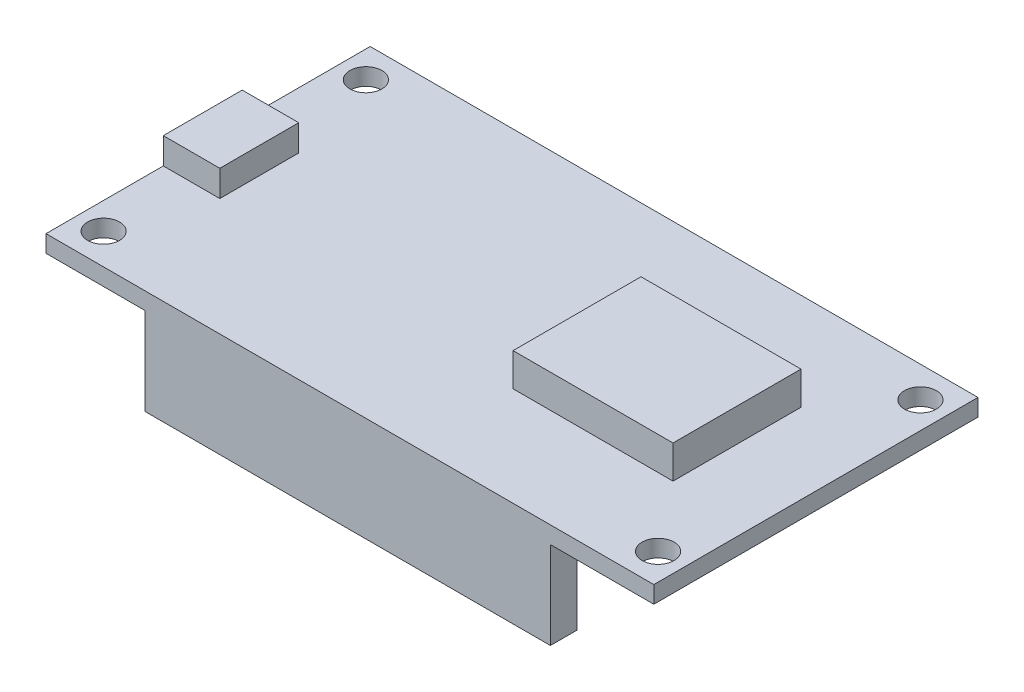
ISO-10303-21;
HEADER;
FILE_DESCRIPTION(('STEP AP214'),'2;1');
FILE_NAME('part.step','',(''),(''),'','','');
FILE_SCHEMA(('AUTOMOTIVE_DESIGN { 1 0 10303 214 1 1 1 1 }'));
ENDSEC;
DATA;
#1=APPLICATION_CONTEXT('core data for automotive mechanical design processes');
#2=APPLICATION_PROTOCOL_DEFINITION('international standard','automotive_design',2000,#1);
#3=PRODUCT_CONTEXT('',#1,'mechanical');
#4=PRODUCT('Part','Part','',(#3));
#5=PRODUCT_RELATED_PRODUCT_CATEGORY('part','',(#4));
#6=PRODUCT_DEFINITION_FORMATION('','',#4);
#7=PRODUCT_DEFINITION_CONTEXT('part definition',#1,'design');
#8=PRODUCT_DEFINITION('design','',#6,#7);
#9=PRODUCT_DEFINITION_SHAPE('','',#8);
#10=(LENGTH_UNIT() NAMED_UNIT(*) SI_UNIT(.MILLI.,.METRE.));
#11=(NAMED_UNIT(*) PLANE_ANGLE_UNIT() SI_UNIT($,.RADIAN.));
#12=(NAMED_UNIT(*) SI_UNIT($,.STERADIAN.) SOLID_ANGLE_UNIT());
#13=UNCERTAINTY_MEASURE_WITH_UNIT(LENGTH_MEASURE(1.E-05),#10,'distance_accuracy_value','');
#14=(GEOMETRIC_REPRESENTATION_CONTEXT(3) GLOBAL_UNCERTAINTY_ASSIGNED_CONTEXT((#13)) GLOBAL_UNIT_ASSIGNED_CONTEXT((#10,
#11,#12)) REPRESENTATION_CONTEXT('',''));
#15=CARTESIAN_POINT('',(0.,0.,0.));
#16=DIRECTION('',(0.,0.,1.));
#17=DIRECTION('',(1.,0.,0.));
#18=AXIS2_PLACEMENT_3D('',#15,#16,#17);
#19=CARTESIAN_POINT('',(0.,0.,0.));
#20=DIRECTION('',(0.,1.,0.));
#21=DIRECTION('',(0.,0.,1.));
#22=AXIS2_PLACEMENT_3D('',#19,#20,#21);
#23=PLANE('',#22);
#24=CARTESIAN_POINT('',(35.099869201977,0.,-10.2520100502513));
#25=DIRECTION('',(0.,1.,0.));
#26=DIRECTION('',(0.,0.,1.));
#27=AXIS2_PLACEMENT_3D('',#24,#25,#26);
#28=CIRCLE('',#27,1.5);
#29=CARTESIAN_POINT('',(35.099869201977,0.,-8.75201005025125));
#30=VERTEX_POINT('',#29);
#31=EDGE_CURVE('E237',#30,#30,#28,.T.);
#32=ORIENTED_EDGE('',*,*,#31,.T.);
#33=EDGE_LOOP('',(#32));
#34=FACE_BOUND('',#33,.T.);
#35=CARTESIAN_POINT('',(35.099869201977,0.,14.3479899497487));
#36=DIRECTION('',(0.,1.,0.));
#37=DIRECTION('',(0.,0.,1.));
#38=AXIS2_PLACEMENT_3D('',#35,#36,#37);
#39=CIRCLE('',#38,1.5);
#40=CARTESIAN_POINT('',(35.099869201977,0.,15.8479899497487));
#41=VERTEX_POINT('',#40);
#42=EDGE_CURVE('E231',#41,#41,#39,.T.);
#43=ORIENTED_EDGE('',*,*,#42,.T.);
#44=EDGE_LOOP('',(#43));
#45=FACE_BOUND('',#44,.T.);
#46=CARTESIAN_POINT('',(-16.900130798023,0.,14.3479899497487));
#47=DIRECTION('',(0.,1.,0.));
#48=DIRECTION('',(0.,0.,1.));
#49=AXIS2_PLACEMENT_3D('',#46,#47,#48);
#50=CIRCLE('',#49,1.5);
#51=CARTESIAN_POINT('',(-16.900130798023,0.,15.8479899497487));
#52=VERTEX_POINT('',#51);
#53=EDGE_CURVE('E224',#52,#52,#50,.T.);
#54=ORIENTED_EDGE('',*,*,#53,.T.);
#55=EDGE_LOOP('',(#54));
#56=FACE_BOUND('',#55,.T.);
#57=CARTESIAN_POINT('',(-16.900130798023,0.,-10.2520100502513));
#58=DIRECTION('',(0.,1.,0.));
#59=DIRECTION('',(0.,0.,1.));
#60=AXIS2_PLACEMENT_3D('',#57,#58,#59);
#61=CIRCLE('',#60,1.5);
#62=CARTESIAN_POINT('',(-16.900130798023,0.,-8.75201005025126));
#63=VERTEX_POINT('',#62);
#64=EDGE_CURVE('E242',#63,#63,#61,.T.);
#65=ORIENTED_EDGE('',*,*,#64,.T.);
#66=EDGE_LOOP('',(#65));
#67=FACE_BOUND('',#66,.T.);
#68=DIRECTION('',(0.,0.,-1.));
#69=VECTOR('',#68,1.);
#70=CARTESIAN_POINT('',(-10.100130798023,0.,-10.6520100502513));
#71=LINE('',#70,#69);
#72=CARTESIAN_POINT('',(-10.100130798023,0.,-10.6520100502513));
#73=VERTEX_POINT('',#72);
#74=CARTESIAN_POINT('',(-10.100130798023,0.,-13.1520100502513));
#75=VERTEX_POINT('',#74);
#76=EDGE_CURVE('E48',#73,#75,#71,.T.);
#77=ORIENTED_EDGE('',*,*,#76,.F.);
#78=DIRECTION('',(-1.,0.,0.));
#79=VECTOR('',#78,1.);
#80=CARTESIAN_POINT('',(-10.100130798023,0.,-10.6520100502513));
#81=LINE('',#80,#79);
#82=CARTESIAN_POINT('',(27.899869201977,0.,-10.6520100502513));
#83=VERTEX_POINT('',#82);
#84=EDGE_CURVE('E188',#83,#73,#81,.T.);
#85=ORIENTED_EDGE('',*,*,#84,.F.);
#86=DIRECTION('',(0.,0.,1.));
#87=VECTOR('',#86,1.);
#88=CARTESIAN_POINT('',(27.899869201977,0.,-10.6520100502513));
#89=LINE('',#88,#87);
#90=CARTESIAN_POINT('',(27.899869201977,0.,-13.1520100502513));
#91=VERTEX_POINT('',#90);
#92=EDGE_CURVE('E344',#91,#83,#89,.T.);
#93=ORIENTED_EDGE('',*,*,#92,.F.);
#94=DIRECTION('',(-1.,0.,0.));
#95=VECTOR('',#94,1.);
#96=CARTESIAN_POINT('',(-19.400130798023,0.,-13.1520100502513));
#97=LINE('',#96,#95);
#98=CARTESIAN_POINT('',(37.599869201977,0.,-13.1520100502513));
#99=VERTEX_POINT('',#98);
#100=EDGE_CURVE('E326',#99,#91,#97,.T.);
#101=ORIENTED_EDGE('',*,*,#100,.F.);
#102=DIRECTION('',(0.,0.,-1.));
#103=VECTOR('',#102,1.);
#104=CARTESIAN_POINT('',(37.599869201977,0.,-13.1520100502513));
#105=LINE('',#104,#103);
#106=CARTESIAN_POINT('',(37.599869201977,0.,17.2479899497487));
#107=VERTEX_POINT('',#106);
#108=EDGE_CURVE('E323',#107,#99,#105,.T.);
#109=ORIENTED_EDGE('',*,*,#108,.F.);
#110=DIRECTION('',(1.,0.,0.));
#111=VECTOR('',#110,1.);
#112=CARTESIAN_POINT('',(-19.400130798023,0.,17.2479899497487));
#113=LINE('',#112,#111);
#114=CARTESIAN_POINT('',(27.899869201977,0.,17.2479899497487));
#115=VERTEX_POINT('',#114);
#116=EDGE_CURVE('E319',#115,#107,#113,.T.);
#117=ORIENTED_EDGE('',*,*,#116,.F.);
#118=DIRECTION('',(0.,0.,1.));
#119=VECTOR('',#118,1.);
#120=CARTESIAN_POINT('',(27.899869201977,0.,17.2479899497487));
#121=LINE('',#120,#119);
#122=CARTESIAN_POINT('',(27.899869201977,0.,14.7479899497487));
#123=VERTEX_POINT('',#122);
#124=EDGE_CURVE('E203',#123,#115,#121,.T.);
#125=ORIENTED_EDGE('',*,*,#124,.F.);
#126=DIRECTION('',(1.,0.,0.));
#127=VECTOR('',#126,1.);
#128=CARTESIAN_POINT('',(-10.100130798023,0.,14.7479899497487));
#129=LINE('',#128,#127);
#130=CARTESIAN_POINT('',(-10.100130798023,0.,14.7479899497487));
#131=VERTEX_POINT('',#130);
#132=EDGE_CURVE('E56',#131,#123,#129,.T.);
#133=ORIENTED_EDGE('',*,*,#132,.F.);
#134=DIRECTION('',(0.,0.,-1.));
#135=VECTOR('',#134,1.);
#136=CARTESIAN_POINT('',(-10.100130798023,0.,17.2479899497487));
#137=LINE('',#136,#135);
#138=CARTESIAN_POINT('',(-10.100130798023,0.,17.2479899497487));
#139=VERTEX_POINT('',#138);
#140=EDGE_CURVE('E191',#139,#131,#137,.T.);
#141=ORIENTED_EDGE('',*,*,#140,.F.);
#142=CARTESIAN_POINT('',(-19.400130798023,0.,17.2479899497487));
#143=VERTEX_POINT('',#142);
#144=EDGE_CURVE('E320',#143,#139,#113,.T.);
#145=ORIENTED_EDGE('',*,*,#144,.F.);
#146=DIRECTION('',(0.,0.,1.));
#147=VECTOR('',#146,1.);
#148=CARTESIAN_POINT('',(-19.400130798023,0.,-13.1520100502513));
#149=LINE('',#148,#147);
#150=CARTESIAN_POINT('',(-19.400130798023,0.,-13.1520100502513));
#151=VERTEX_POINT('',#150);
#152=EDGE_CURVE('E306',#151,#143,#149,.T.);
#153=ORIENTED_EDGE('',*,*,#152,.F.);
#154=EDGE_CURVE('E325',#75,#151,#97,.T.);
#155=ORIENTED_EDGE('',*,*,#154,.F.);
#156=EDGE_LOOP('',(#77,#85,#93,#101,#109,#117,#125,#133,#141,#145,#153,#155));
#157=FACE_BOUND('',#156,.T.);
#158=ADVANCED_FACE('F33',(#34,#45,#56,#67,#157),#23,.F.);
#159=CARTESIAN_POINT('',(0.,1.6,0.));
#160=DIRECTION('',(0.,1.,0.));
#161=DIRECTION('',(0.,0.,1.));
#162=AXIS2_PLACEMENT_3D('',#159,#160,#161);
#163=PLANE('',#162);
#164=CARTESIAN_POINT('',(35.099869201977,1.6,-10.2520100502513));
#165=DIRECTION('',(0.,1.,0.));
#166=DIRECTION('',(0.,0.,1.));
#167=AXIS2_PLACEMENT_3D('',#164,#165,#166);
#168=CIRCLE('',#167,1.5);
#169=CARTESIAN_POINT('',(35.099869201977,1.6,-8.75201005025125));
#170=VERTEX_POINT('',#169);
#171=EDGE_CURVE('E223',#170,#170,#168,.T.);
#172=ORIENTED_EDGE('',*,*,#171,.F.);
#173=EDGE_LOOP('',(#172));
#174=FACE_BOUND('',#173,.T.);
#175=CARTESIAN_POINT('',(35.099869201977,1.6,14.3479899497487));
#176=DIRECTION('',(0.,1.,0.));
#177=DIRECTION('',(0.,0.,1.));
#178=AXIS2_PLACEMENT_3D('',#175,#176,#177);
#179=CIRCLE('',#178,1.5);
#180=CARTESIAN_POINT('',(35.099869201977,1.6,15.8479899497487));
#181=VERTEX_POINT('',#180);
#182=EDGE_CURVE('E234',#181,#181,#179,.T.);
#183=ORIENTED_EDGE('',*,*,#182,.F.);
#184=EDGE_LOOP('',(#183));
#185=FACE_BOUND('',#184,.T.);
#186=CARTESIAN_POINT('',(-16.900130798023,1.6,14.3479899497487));
#187=DIRECTION('',(0.,1.,0.));
#188=DIRECTION('',(0.,0.,1.));
#189=AXIS2_PLACEMENT_3D('',#186,#187,#188);
#190=CIRCLE('',#189,1.5);
#191=CARTESIAN_POINT('',(-16.900130798023,1.6,15.8479899497487));
#192=VERTEX_POINT('',#191);
#193=EDGE_CURVE('E228',#192,#192,#190,.T.);
#194=ORIENTED_EDGE('',*,*,#193,.F.);
#195=EDGE_LOOP('',(#194));
#196=FACE_BOUND('',#195,.T.);
#197=CARTESIAN_POINT('',(-16.900130798023,1.6,-10.2520100502513));
#198=DIRECTION('',(0.,1.,0.));
#199=DIRECTION('',(0.,0.,1.));
#200=AXIS2_PLACEMENT_3D('',#197,#198,#199);
#201=CIRCLE('',#200,1.5);
#202=CARTESIAN_POINT('',(-16.900130798023,1.6,-8.75201005025126));
#203=VERTEX_POINT('',#202);
#204=EDGE_CURVE('E227',#203,#203,#201,.T.);
#205=ORIENTED_EDGE('',*,*,#204,.F.);
#206=EDGE_LOOP('',(#205));
#207=FACE_BOUND('',#206,.T.);
#208=DIRECTION('',(1.,0.,0.));
#209=VECTOR('',#208,1.);
#210=CARTESIAN_POINT('',(15.099869201977,1.6,7.94798994974874));
#211=LINE('',#210,#209);
#212=CARTESIAN_POINT('',(15.099869201977,1.6,7.94798994974874));
#213=VERTEX_POINT('',#212);
#214=CARTESIAN_POINT('',(30.099869201977,1.6,7.94798994974874));
#215=VERTEX_POINT('',#214);
#216=EDGE_CURVE('E291',#213,#215,#211,.T.);
#217=ORIENTED_EDGE('',*,*,#216,.F.);
#218=DIRECTION('',(0.,0.,1.));
#219=VECTOR('',#218,1.);
#220=CARTESIAN_POINT('',(15.099869201977,1.6,-4.05201005025126));
#221=LINE('',#220,#219);
#222=CARTESIAN_POINT('',(15.099869201977,1.6,-4.05201005025126));
#223=VERTEX_POINT('',#222);
#224=EDGE_CURVE('E277',#223,#213,#221,.T.);
#225=ORIENTED_EDGE('',*,*,#224,.F.);
#226=DIRECTION('',(-1.,0.,0.));
#227=VECTOR('',#226,1.);
#228=CARTESIAN_POINT('',(15.099869201977,1.6,-4.05201005025126));
#229=LINE('',#228,#227);
#230=CARTESIAN_POINT('',(30.099869201977,1.6,-4.05201005025126));
#231=VERTEX_POINT('',#230);
#232=EDGE_CURVE('E282',#231,#223,#229,.T.);
#233=ORIENTED_EDGE('',*,*,#232,.F.);
#234=DIRECTION('',(0.,0.,-1.));
#235=VECTOR('',#234,1.);
#236=CARTESIAN_POINT('',(30.099869201977,1.6,-4.05201005025126));
#237=LINE('',#236,#235);
#238=EDGE_CURVE('E293',#215,#231,#237,.T.);
#239=ORIENTED_EDGE('',*,*,#238,.F.);
#240=EDGE_LOOP('',(#217,#225,#233,#239));
#241=FACE_BOUND('',#240,.T.);
#242=DIRECTION('',(0.,0.,-1.));
#243=VECTOR('',#242,1.);
#244=CARTESIAN_POINT('',(-14.100130798023,1.6,-1.15201005025126));
#245=LINE('',#244,#243);
#246=CARTESIAN_POINT('',(-14.100130798023,1.6,6.24798994974874));
#247=VERTEX_POINT('',#246);
#248=CARTESIAN_POINT('',(-14.100130798023,1.6,-1.15201005025126));
#249=VERTEX_POINT('',#248);
#250=EDGE_CURVE('E261',#247,#249,#245,.T.);
#251=ORIENTED_EDGE('',*,*,#250,.F.);
#252=DIRECTION('',(1.,0.,0.));
#253=VECTOR('',#252,1.);
#254=CARTESIAN_POINT('',(-19.400130798023,1.6,6.24798994974874));
#255=LINE('',#254,#253);
#256=CARTESIAN_POINT('',(-19.400130798023,1.6,6.24798994974874));
#257=VERTEX_POINT('',#256);
#258=EDGE_CURVE('E245',#257,#247,#255,.T.);
#259=ORIENTED_EDGE('',*,*,#258,.F.);
#260=DIRECTION('',(0.,0.,1.));
#261=VECTOR('',#260,1.);
#262=CARTESIAN_POINT('',(-19.400130798023,1.6,-13.1520100502513));
#263=LINE('',#262,#261);
#264=CARTESIAN_POINT('',(-19.400130798023,1.6,17.2479899497487));
#265=VERTEX_POINT('',#264);
#266=EDGE_CURVE('E310',#257,#265,#263,.T.);
#267=ORIENTED_EDGE('',*,*,#266,.T.);
#268=DIRECTION('',(1.,0.,0.));
#269=VECTOR('',#268,1.);
#270=CARTESIAN_POINT('',(-19.400130798023,1.6,17.2479899497487));
#271=LINE('',#270,#269);
#272=CARTESIAN_POINT('',(37.599869201977,1.6,17.2479899497487));
#273=VERTEX_POINT('',#272);
#274=EDGE_CURVE('E309',#265,#273,#271,.T.);
#275=ORIENTED_EDGE('',*,*,#274,.T.);
#276=DIRECTION('',(0.,0.,-1.));
#277=VECTOR('',#276,1.);
#278=CARTESIAN_POINT('',(37.599869201977,1.6,-13.1520100502513));
#279=LINE('',#278,#277);
#280=CARTESIAN_POINT('',(37.599869201977,1.6,-13.1520100502513));
#281=VERTEX_POINT('',#280);
#282=EDGE_CURVE('E312',#273,#281,#279,.T.);
#283=ORIENTED_EDGE('',*,*,#282,.T.);
#284=DIRECTION('',(-1.,0.,0.));
#285=VECTOR('',#284,1.);
#286=CARTESIAN_POINT('',(-19.400130798023,1.6,-13.1520100502513));
#287=LINE('',#286,#285);
#288=CARTESIAN_POINT('',(-19.400130798023,1.6,-13.1520100502513));
#289=VERTEX_POINT('',#288);
#290=EDGE_CURVE('E314',#281,#289,#287,.T.);
#291=ORIENTED_EDGE('',*,*,#290,.T.);
#292=CARTESIAN_POINT('',(-19.400130798023,1.6,-1.15201005025126));
#293=VERTEX_POINT('',#292);
#294=EDGE_CURVE('E307',#289,#293,#263,.T.);
#295=ORIENTED_EDGE('',*,*,#294,.T.);
#296=DIRECTION('',(-1.,0.,0.));
#297=VECTOR('',#296,1.);
#298=CARTESIAN_POINT('',(-19.400130798023,1.6,-1.15201005025126));
#299=LINE('',#298,#297);
#300=EDGE_CURVE('E252',#249,#293,#299,.T.);
#301=ORIENTED_EDGE('',*,*,#300,.F.);
#302=EDGE_LOOP('',(#251,#259,#267,#275,#283,#291,#295,#301));
#303=FACE_BOUND('',#302,.T.);
#304=ADVANCED_FACE('F349',(#174,#185,#196,#207,#241,#303),#163,.T.);
#305=CARTESIAN_POINT('',(-19.400130798023,1.6,-13.1520100502513));
#306=DIRECTION('',(1.,0.,0.));
#307=DIRECTION('',(0.,0.,-1.));
#308=AXIS2_PLACEMENT_3D('',#305,#306,#307);
#309=PLANE('',#308);
#310=ORIENTED_EDGE('',*,*,#152,.T.);
#311=DIRECTION('',(0.,-1.,0.));
#312=VECTOR('',#311,1.);
#313=CARTESIAN_POINT('',(-19.400130798023,1.6,17.2479899497487));
#314=LINE('',#313,#312);
#315=EDGE_CURVE('E11',#265,#143,#314,.T.);
#316=ORIENTED_EDGE('',*,*,#315,.F.);
#317=ORIENTED_EDGE('',*,*,#266,.F.);
#318=DIRECTION('',(0.,-1.,0.));
#319=VECTOR('',#318,1.);
#320=CARTESIAN_POINT('',(-19.400130798023,4.06,6.24798994974874));
#321=LINE('',#320,#319);
#322=CARTESIAN_POINT('',(-19.400130798023,4.06,6.24798994974874));
#323=VERTEX_POINT('',#322);
#324=EDGE_CURVE('E274',#323,#257,#321,.T.);
#325=ORIENTED_EDGE('',*,*,#324,.F.);
#326=DIRECTION('',(0.,0.,1.));
#327=VECTOR('',#326,1.);
#328=CARTESIAN_POINT('',(-19.400130798023,4.06,-1.15201005025126));
#329=LINE('',#328,#327);
#330=CARTESIAN_POINT('',(-19.400130798023,4.06,-1.15201005025126));
#331=VERTEX_POINT('',#330);
#332=EDGE_CURVE('E248',#331,#323,#329,.T.);
#333=ORIENTED_EDGE('',*,*,#332,.F.);
#334=DIRECTION('',(0.,-1.,0.));
#335=VECTOR('',#334,1.);
#336=CARTESIAN_POINT('',(-19.400130798023,4.06,-1.15201005025126));
#337=LINE('',#336,#335);
#338=EDGE_CURVE('E258',#331,#293,#337,.T.);
#339=ORIENTED_EDGE('',*,*,#338,.T.);
#340=ORIENTED_EDGE('',*,*,#294,.F.);
#341=DIRECTION('',(0.,-1.,0.));
#342=VECTOR('',#341,1.);
#343=CARTESIAN_POINT('',(-19.400130798023,1.6,-13.1520100502513));
#344=LINE('',#343,#342);
#345=EDGE_CURVE('E316',#289,#151,#344,.T.);
#346=ORIENTED_EDGE('',*,*,#345,.T.);
#347=EDGE_LOOP('',(#310,#316,#317,#325,#333,#339,#340,#346));
#348=FACE_BOUND('',#347,.T.);
#349=ADVANCED_FACE('F35',(#348),#309,.F.);
#350=CARTESIAN_POINT('',(-19.400130798023,1.6,17.2479899497487));
#351=DIRECTION('',(0.,0.,-1.));
#352=DIRECTION('',(-1.,0.,0.));
#353=AXIS2_PLACEMENT_3D('',#350,#351,#352);
#354=PLANE('',#353);
#355=ORIENTED_EDGE('',*,*,#144,.T.);
#356=DIRECTION('',(0.,1.,0.));
#357=VECTOR('',#356,1.);
#358=CARTESIAN_POINT('',(-10.100130798023,-8.2,17.2479899497487));
#359=LINE('',#358,#357);
#360=CARTESIAN_POINT('',(-10.100130798023,-8.2,17.2479899497487));
#361=VERTEX_POINT('',#360);
#362=EDGE_CURVE('E208',#361,#139,#359,.T.);
#363=ORIENTED_EDGE('',*,*,#362,.F.);
#364=DIRECTION('',(-1.,0.,0.));
#365=VECTOR('',#364,1.);
#366=CARTESIAN_POINT('',(-10.100130798023,-8.2,17.2479899497487));
#367=LINE('',#366,#365);
#368=CARTESIAN_POINT('',(27.899869201977,-8.2,17.2479899497487));
#369=VERTEX_POINT('',#368);
#370=EDGE_CURVE('E207',#369,#361,#367,.T.);
#371=ORIENTED_EDGE('',*,*,#370,.F.);
#372=DIRECTION('',(0.,1.,0.));
#373=VECTOR('',#372,1.);
#374=CARTESIAN_POINT('',(27.899869201977,-8.2,17.2479899497487));
#375=LINE('',#374,#373);
#376=EDGE_CURVE('E215',#369,#115,#375,.T.);
#377=ORIENTED_EDGE('',*,*,#376,.T.);
#378=ORIENTED_EDGE('',*,*,#116,.T.);
#379=DIRECTION('',(0.,-1.,0.));
#380=VECTOR('',#379,1.);
#381=CARTESIAN_POINT('',(37.599869201977,1.6,17.2479899497487));
#382=LINE('',#381,#380);
#383=EDGE_CURVE('E41',#273,#107,#382,.T.);
#384=ORIENTED_EDGE('',*,*,#383,.F.);
#385=ORIENTED_EDGE('',*,*,#274,.F.);
#386=ORIENTED_EDGE('',*,*,#315,.T.);
#387=EDGE_LOOP('',(#355,#363,#371,#377,#378,#384,#385,#386));
#388=FACE_BOUND('',#387,.T.);
#389=ADVANCED_FACE('F352',(#388),#354,.F.);
#390=CARTESIAN_POINT('',(37.599869201977,1.6,-13.1520100502513));
#391=DIRECTION('',(-1.,0.,0.));
#392=DIRECTION('',(0.,0.,1.));
#393=AXIS2_PLACEMENT_3D('',#390,#391,#392);
#394=PLANE('',#393);
#395=ORIENTED_EDGE('',*,*,#108,.T.);
#396=DIRECTION('',(0.,-1.,0.));
#397=VECTOR('',#396,1.);
#398=CARTESIAN_POINT('',(37.599869201977,1.6,-13.1520100502513));
#399=LINE('',#398,#397);
#400=EDGE_CURVE('E330',#281,#99,#399,.T.);
#401=ORIENTED_EDGE('',*,*,#400,.F.);
#402=ORIENTED_EDGE('',*,*,#282,.F.);
#403=ORIENTED_EDGE('',*,*,#383,.T.);
#404=EDGE_LOOP('',(#395,#401,#402,#403));
#405=FACE_BOUND('',#404,.T.);
#406=ADVANCED_FACE('F337',(#405),#394,.F.);
#407=CARTESIAN_POINT('',(-19.400130798023,1.6,-13.1520100502513));
#408=DIRECTION('',(0.,0.,1.));
#409=DIRECTION('',(1.,0.,0.));
#410=AXIS2_PLACEMENT_3D('',#407,#408,#409);
#411=PLANE('',#410);
#412=ORIENTED_EDGE('',*,*,#100,.T.);
#413=DIRECTION('',(0.,1.,0.));
#414=VECTOR('',#413,1.);
#415=CARTESIAN_POINT('',(27.899869201977,-8.2,-13.1520100502513));
#416=LINE('',#415,#414);
#417=CARTESIAN_POINT('',(27.899869201977,-8.2,-13.1520100502513));
#418=VERTEX_POINT('',#417);
#419=EDGE_CURVE('E177',#418,#91,#416,.T.);
#420=ORIENTED_EDGE('',*,*,#419,.F.);
#421=DIRECTION('',(1.,0.,0.));
#422=VECTOR('',#421,1.);
#423=CARTESIAN_POINT('',(-10.100130798023,-8.2,-13.1520100502513));
#424=LINE('',#423,#422);
#425=CARTESIAN_POINT('',(-10.100130798023,-8.2,-13.1520100502513));
#426=VERTEX_POINT('',#425);
#427=EDGE_CURVE('E171',#426,#418,#424,.T.);
#428=ORIENTED_EDGE('',*,*,#427,.F.);
#429=DIRECTION('',(0.,1.,0.));
#430=VECTOR('',#429,1.);
#431=CARTESIAN_POINT('',(-10.100130798023,-8.2,-13.1520100502513));
#432=LINE('',#431,#430);
#433=EDGE_CURVE('E175',#426,#75,#432,.T.);
#434=ORIENTED_EDGE('',*,*,#433,.T.);
#435=ORIENTED_EDGE('',*,*,#154,.T.);
#436=ORIENTED_EDGE('',*,*,#345,.F.);
#437=ORIENTED_EDGE('',*,*,#290,.F.);
#438=ORIENTED_EDGE('',*,*,#400,.T.);
#439=EDGE_LOOP('',(#412,#420,#428,#434,#435,#436,#437,#438));
#440=FACE_BOUND('',#439,.T.);
#441=ADVANCED_FACE('F174',(#440),#411,.F.);
#442=CARTESIAN_POINT('',(15.099869201977,4.7,-4.05201005025126));
#443=DIRECTION('',(1.,0.,0.));
#444=DIRECTION('',(0.,0.,-1.));
#445=AXIS2_PLACEMENT_3D('',#442,#443,#444);
#446=PLANE('',#445);
#447=ORIENTED_EDGE('',*,*,#224,.T.);
#448=DIRECTION('',(0.,-1.,0.));
#449=VECTOR('',#448,1.);
#450=CARTESIAN_POINT('',(15.099869201977,4.7,7.94798994974874));
#451=LINE('',#450,#449);
#452=CARTESIAN_POINT('',(15.099869201977,4.7,7.94798994974874));
#453=VERTEX_POINT('',#452);
#454=EDGE_CURVE('E304',#453,#213,#451,.T.);
#455=ORIENTED_EDGE('',*,*,#454,.F.);
#456=DIRECTION('',(0.,0.,1.));
#457=VECTOR('',#456,1.);
#458=CARTESIAN_POINT('',(15.099869201977,4.7,-4.05201005025126));
#459=LINE('',#458,#457);
#460=CARTESIAN_POINT('',(15.099869201977,4.7,-4.05201005025126));
#461=VERTEX_POINT('',#460);
#462=EDGE_CURVE('E278',#461,#453,#459,.T.);
#463=ORIENTED_EDGE('',*,*,#462,.F.);
#464=DIRECTION('',(0.,-1.,0.));
#465=VECTOR('',#464,1.);
#466=CARTESIAN_POINT('',(15.099869201977,4.7,-4.05201005025126));
#467=LINE('',#466,#465);
#468=EDGE_CURVE('E288',#461,#223,#467,.T.);
#469=ORIENTED_EDGE('',*,*,#468,.T.);
#470=EDGE_LOOP('',(#447,#455,#463,#469));
#471=FACE_BOUND('',#470,.T.);
#472=ADVANCED_FACE('F393',(#471),#446,.F.);
#473=CARTESIAN_POINT('',(15.099869201977,4.7,7.94798994974874));
#474=DIRECTION('',(0.,0.,-1.));
#475=DIRECTION('',(-1.,0.,0.));
#476=AXIS2_PLACEMENT_3D('',#473,#474,#475);
#477=PLANE('',#476);
#478=ORIENTED_EDGE('',*,*,#216,.T.);
#479=DIRECTION('',(0.,-1.,0.));
#480=VECTOR('',#479,1.);
#481=CARTESIAN_POINT('',(30.099869201977,4.7,7.94798994974874));
#482=LINE('',#481,#480);
#483=CARTESIAN_POINT('',(30.099869201977,4.7,7.94798994974874));
#484=VERTEX_POINT('',#483);
#485=EDGE_CURVE('E301',#484,#215,#482,.T.);
#486=ORIENTED_EDGE('',*,*,#485,.F.);
#487=DIRECTION('',(1.,0.,0.));
#488=VECTOR('',#487,1.);
#489=CARTESIAN_POINT('',(15.099869201977,4.7,7.94798994974874));
#490=LINE('',#489,#488);
#491=EDGE_CURVE('E281',#453,#484,#490,.T.);
#492=ORIENTED_EDGE('',*,*,#491,.F.);
#493=ORIENTED_EDGE('',*,*,#454,.T.);
#494=EDGE_LOOP('',(#478,#486,#492,#493));
#495=FACE_BOUND('',#494,.T.);
#496=ADVANCED_FACE('F548',(#495),#477,.F.);
#497=CARTESIAN_POINT('',(30.099869201977,4.7,-4.05201005025126));
#498=DIRECTION('',(-1.,0.,0.));
#499=DIRECTION('',(0.,0.,1.));
#500=AXIS2_PLACEMENT_3D('',#497,#498,#499);
#501=PLANE('',#500);
#502=ORIENTED_EDGE('',*,*,#238,.T.);
#503=DIRECTION('',(0.,-1.,0.));
#504=VECTOR('',#503,1.);
#505=CARTESIAN_POINT('',(30.099869201977,4.7,-4.05201005025126));
#506=LINE('',#505,#504);
#507=CARTESIAN_POINT('',(30.099869201977,4.7,-4.05201005025126));
#508=VERTEX_POINT('',#507);
#509=EDGE_CURVE('E299',#508,#231,#506,.T.);
#510=ORIENTED_EDGE('',*,*,#509,.F.);
#511=DIRECTION('',(0.,0.,-1.));
#512=VECTOR('',#511,1.);
#513=CARTESIAN_POINT('',(30.099869201977,4.7,-4.05201005025126));
#514=LINE('',#513,#512);
#515=EDGE_CURVE('E284',#484,#508,#514,.T.);
#516=ORIENTED_EDGE('',*,*,#515,.F.);
#517=ORIENTED_EDGE('',*,*,#485,.T.);
#518=EDGE_LOOP('',(#502,#510,#516,#517));
#519=FACE_BOUND('',#518,.T.);
#520=ADVANCED_FACE('F555',(#519),#501,.F.);
#521=CARTESIAN_POINT('',(15.099869201977,4.7,-4.05201005025126));
#522=DIRECTION('',(0.,0.,1.));
#523=DIRECTION('',(1.,0.,0.));
#524=AXIS2_PLACEMENT_3D('',#521,#522,#523);
#525=PLANE('',#524);
#526=ORIENTED_EDGE('',*,*,#232,.T.);
#527=ORIENTED_EDGE('',*,*,#468,.F.);
#528=DIRECTION('',(-1.,0.,0.));
#529=VECTOR('',#528,1.);
#530=CARTESIAN_POINT('',(15.099869201977,4.7,-4.05201005025126));
#531=LINE('',#530,#529);
#532=EDGE_CURVE('E286',#508,#461,#531,.T.);
#533=ORIENTED_EDGE('',*,*,#532,.F.);
#534=ORIENTED_EDGE('',*,*,#509,.T.);
#535=EDGE_LOOP('',(#526,#527,#533,#534));
#536=FACE_BOUND('',#535,.T.);
#537=ADVANCED_FACE('F563',(#536),#525,.F.);
#538=CARTESIAN_POINT('',(0.,4.7,0.));
#539=DIRECTION('',(0.,1.,0.));
#540=DIRECTION('',(0.,0.,1.));
#541=AXIS2_PLACEMENT_3D('',#538,#539,#540);
#542=PLANE('',#541);
#543=ORIENTED_EDGE('',*,*,#462,.T.);
#544=ORIENTED_EDGE('',*,*,#491,.T.);
#545=ORIENTED_EDGE('',*,*,#515,.T.);
#546=ORIENTED_EDGE('',*,*,#532,.T.);
#547=EDGE_LOOP('',(#543,#544,#545,#546));
#548=FACE_BOUND('',#547,.T.);
#549=ADVANCED_FACE('F571',(#548),#542,.T.);
#550=CARTESIAN_POINT('',(-19.400130798023,4.06,6.24798994974874));
#551=DIRECTION('',(0.,0.,-1.));
#552=DIRECTION('',(-1.,0.,0.));
#553=AXIS2_PLACEMENT_3D('',#550,#551,#552);
#554=PLANE('',#553);
#555=ORIENTED_EDGE('',*,*,#258,.T.);
#556=DIRECTION('',(0.,-1.,0.));
#557=VECTOR('',#556,1.);
#558=CARTESIAN_POINT('',(-14.100130798023,4.06,6.24798994974874));
#559=LINE('',#558,#557);
#560=CARTESIAN_POINT('',(-14.100130798023,4.06,6.24798994974874));
#561=VERTEX_POINT('',#560);
#562=EDGE_CURVE('E271',#561,#247,#559,.T.);
#563=ORIENTED_EDGE('',*,*,#562,.F.);
#564=DIRECTION('',(1.,0.,0.));
#565=VECTOR('',#564,1.);
#566=CARTESIAN_POINT('',(-19.400130798023,4.06,6.24798994974874));
#567=LINE('',#566,#565);
#568=EDGE_CURVE('E251',#323,#561,#567,.T.);
#569=ORIENTED_EDGE('',*,*,#568,.F.);
#570=ORIENTED_EDGE('',*,*,#324,.T.);
#571=EDGE_LOOP('',(#555,#563,#569,#570));
#572=FACE_BOUND('',#571,.T.);
#573=ADVANCED_FACE('F578',(#572),#554,.F.);
#574=CARTESIAN_POINT('',(-14.100130798023,4.06,-1.15201005025126));
#575=DIRECTION('',(-1.,0.,0.));
#576=DIRECTION('',(0.,0.,1.));
#577=AXIS2_PLACEMENT_3D('',#574,#575,#576);
#578=PLANE('',#577);
#579=ORIENTED_EDGE('',*,*,#250,.T.);
#580=DIRECTION('',(0.,-1.,0.));
#581=VECTOR('',#580,1.);
#582=CARTESIAN_POINT('',(-14.100130798023,4.06,-1.15201005025126));
#583=LINE('',#582,#581);
#584=CARTESIAN_POINT('',(-14.100130798023,4.06,-1.15201005025126));
#585=VERTEX_POINT('',#584);
#586=EDGE_CURVE('E268',#585,#249,#583,.T.);
#587=ORIENTED_EDGE('',*,*,#586,.F.);
#588=DIRECTION('',(0.,0.,-1.));
#589=VECTOR('',#588,1.);
#590=CARTESIAN_POINT('',(-14.100130798023,4.06,-1.15201005025126));
#591=LINE('',#590,#589);
#592=EDGE_CURVE('E254',#561,#585,#591,.T.);
#593=ORIENTED_EDGE('',*,*,#592,.F.);
#594=ORIENTED_EDGE('',*,*,#562,.T.);
#595=EDGE_LOOP('',(#579,#587,#593,#594));
#596=FACE_BOUND('',#595,.T.);
#597=ADVANCED_FACE('F584',(#596),#578,.F.);
#598=CARTESIAN_POINT('',(-19.400130798023,4.06,-1.15201005025126));
#599=DIRECTION('',(0.,0.,1.));
#600=DIRECTION('',(1.,0.,0.));
#601=AXIS2_PLACEMENT_3D('',#598,#599,#600);
#602=PLANE('',#601);
#603=ORIENTED_EDGE('',*,*,#300,.T.);
#604=ORIENTED_EDGE('',*,*,#338,.F.);
#605=DIRECTION('',(-1.,0.,0.));
#606=VECTOR('',#605,1.);
#607=CARTESIAN_POINT('',(-19.400130798023,4.06,-1.15201005025126));
#608=LINE('',#607,#606);
#609=EDGE_CURVE('E256',#585,#331,#608,.T.);
#610=ORIENTED_EDGE('',*,*,#609,.F.);
#611=ORIENTED_EDGE('',*,*,#586,.T.);
#612=EDGE_LOOP('',(#603,#604,#610,#611));
#613=FACE_BOUND('',#612,.T.);
#614=ADVANCED_FACE('F592',(#613),#602,.F.);
#615=CARTESIAN_POINT('',(0.,4.06,0.));
#616=DIRECTION('',(0.,1.,0.));
#617=DIRECTION('',(0.,0.,1.));
#618=AXIS2_PLACEMENT_3D('',#615,#616,#617);
#619=PLANE('',#618);
#620=ORIENTED_EDGE('',*,*,#332,.T.);
#621=ORIENTED_EDGE('',*,*,#568,.T.);
#622=ORIENTED_EDGE('',*,*,#592,.T.);
#623=ORIENTED_EDGE('',*,*,#609,.T.);
#624=EDGE_LOOP('',(#620,#621,#622,#623));
#625=FACE_BOUND('',#624,.T.);
#626=ADVANCED_FACE('F414',(#625),#619,.T.);
#627=CARTESIAN_POINT('',(-16.900130798023,0.,-10.2520100502513));
#628=DIRECTION('',(0.,1.,0.));
#629=DIRECTION('',(0.,0.,1.));
#630=AXIS2_PLACEMENT_3D('',#627,#628,#629);
#631=CYLINDRICAL_SURFACE('',#630,1.5);
#632=ORIENTED_EDGE('',*,*,#64,.F.);
#633=EDGE_LOOP('',(#632));
#634=FACE_BOUND('',#633,.T.);
#635=ORIENTED_EDGE('',*,*,#204,.T.);
#636=EDGE_LOOP('',(#635));
#637=FACE_BOUND('',#636,.T.);
#638=ADVANCED_FACE('F419',(#634,#637),#631,.F.);
#639=CARTESIAN_POINT('',(-16.900130798023,0.,14.3479899497487));
#640=DIRECTION('',(0.,1.,0.));
#641=DIRECTION('',(0.,0.,1.));
#642=AXIS2_PLACEMENT_3D('',#639,#640,#641);
#643=CYLINDRICAL_SURFACE('',#642,1.5);
#644=ORIENTED_EDGE('',*,*,#53,.F.);
#645=EDGE_LOOP('',(#644));
#646=FACE_BOUND('',#645,.T.);
#647=ORIENTED_EDGE('',*,*,#193,.T.);
#648=EDGE_LOOP('',(#647));
#649=FACE_BOUND('',#648,.T.);
#650=ADVANCED_FACE('F424',(#646,#649),#643,.F.);
#651=CARTESIAN_POINT('',(35.099869201977,0.,14.3479899497487));
#652=DIRECTION('',(0.,1.,0.));
#653=DIRECTION('',(0.,0.,1.));
#654=AXIS2_PLACEMENT_3D('',#651,#652,#653);
#655=CYLINDRICAL_SURFACE('',#654,1.5);
#656=ORIENTED_EDGE('',*,*,#42,.F.);
#657=EDGE_LOOP('',(#656));
#658=FACE_BOUND('',#657,.T.);
#659=ORIENTED_EDGE('',*,*,#182,.T.);
#660=EDGE_LOOP('',(#659));
#661=FACE_BOUND('',#660,.T.);
#662=ADVANCED_FACE('F434',(#658,#661),#655,.F.);
#663=CARTESIAN_POINT('',(35.099869201977,0.,-10.2520100502513));
#664=DIRECTION('',(0.,1.,0.));
#665=DIRECTION('',(0.,0.,1.));
#666=AXIS2_PLACEMENT_3D('',#663,#664,#665);
#667=CYLINDRICAL_SURFACE('',#666,1.5);
#668=ORIENTED_EDGE('',*,*,#31,.F.);
#669=EDGE_LOOP('',(#668));
#670=FACE_BOUND('',#669,.T.);
#671=ORIENTED_EDGE('',*,*,#171,.T.);
#672=EDGE_LOOP('',(#671));
#673=FACE_BOUND('',#672,.T.);
#674=ADVANCED_FACE('F378',(#670,#673),#667,.F.);
#675=CARTESIAN_POINT('',(-10.100130798023,-8.2,17.2479899497487));
#676=DIRECTION('',(1.,0.,0.));
#677=DIRECTION('',(0.,0.,-1.));
#678=AXIS2_PLACEMENT_3D('',#675,#676,#677);
#679=PLANE('',#678);
#680=ORIENTED_EDGE('',*,*,#140,.T.);
#681=DIRECTION('',(0.,1.,0.));
#682=VECTOR('',#681,1.);
#683=CARTESIAN_POINT('',(-10.100130798023,-8.2,14.7479899497487));
#684=LINE('',#683,#682);
#685=CARTESIAN_POINT('',(-10.100130798023,-8.2,14.7479899497487));
#686=VERTEX_POINT('',#685);
#687=EDGE_CURVE('E221',#686,#131,#684,.T.);
#688=ORIENTED_EDGE('',*,*,#687,.F.);
#689=DIRECTION('',(0.,0.,-1.));
#690=VECTOR('',#689,1.);
#691=CARTESIAN_POINT('',(-10.100130798023,-8.2,17.2479899497487));
#692=LINE('',#691,#690);
#693=EDGE_CURVE('E199',#361,#686,#692,.T.);
#694=ORIENTED_EDGE('',*,*,#693,.F.);
#695=ORIENTED_EDGE('',*,*,#362,.T.);
#696=EDGE_LOOP('',(#680,#688,#694,#695));
#697=FACE_BOUND('',#696,.T.);
#698=ADVANCED_FACE('F360',(#697),#679,.F.);
#699=CARTESIAN_POINT('',(-10.100130798023,-8.2,14.7479899497487));
#700=DIRECTION('',(0.,0.,1.));
#701=DIRECTION('',(1.,0.,0.));
#702=AXIS2_PLACEMENT_3D('',#699,#700,#701);
#703=PLANE('',#702);
#704=ORIENTED_EDGE('',*,*,#132,.T.);
#705=DIRECTION('',(0.,1.,0.));
#706=VECTOR('',#705,1.);
#707=CARTESIAN_POINT('',(27.899869201977,-8.2,14.7479899497487));
#708=LINE('',#707,#706);
#709=CARTESIAN_POINT('',(27.899869201977,-8.2,14.7479899497487));
#710=VERTEX_POINT('',#709);
#711=EDGE_CURVE('E218',#710,#123,#708,.T.);
#712=ORIENTED_EDGE('',*,*,#711,.F.);
#713=DIRECTION('',(1.,0.,0.));
#714=VECTOR('',#713,1.);
#715=CARTESIAN_POINT('',(-10.100130798023,-8.2,14.7479899497487));
#716=LINE('',#715,#714);
#717=EDGE_CURVE('E202',#686,#710,#716,.T.);
#718=ORIENTED_EDGE('',*,*,#717,.F.);
#719=ORIENTED_EDGE('',*,*,#687,.T.);
#720=EDGE_LOOP('',(#704,#712,#718,#719));
#721=FACE_BOUND('',#720,.T.);
#722=ADVANCED_FACE('F370',(#721),#703,.F.);
#723=CARTESIAN_POINT('',(27.899869201977,-8.2,17.2479899497487));
#724=DIRECTION('',(-1.,0.,0.));
#725=DIRECTION('',(0.,0.,1.));
#726=AXIS2_PLACEMENT_3D('',#723,#724,#725);
#727=PLANE('',#726);
#728=ORIENTED_EDGE('',*,*,#124,.T.);
#729=ORIENTED_EDGE('',*,*,#376,.F.);
#730=DIRECTION('',(0.,0.,1.));
#731=VECTOR('',#730,1.);
#732=CARTESIAN_POINT('',(27.899869201977,-8.2,17.2479899497487));
#733=LINE('',#732,#731);
#734=EDGE_CURVE('E205',#710,#369,#733,.T.);
#735=ORIENTED_EDGE('',*,*,#734,.F.);
#736=ORIENTED_EDGE('',*,*,#711,.T.);
#737=EDGE_LOOP('',(#728,#729,#735,#736));
#738=FACE_BOUND('',#737,.T.);
#739=ADVANCED_FACE('F368',(#738),#727,.F.);
#740=CARTESIAN_POINT('',(0.,-8.2,0.));
#741=DIRECTION('',(0.,-1.,0.));
#742=DIRECTION('',(0.,0.,-1.));
#743=AXIS2_PLACEMENT_3D('',#740,#741,#742);
#744=PLANE('',#743);
#745=ORIENTED_EDGE('',*,*,#693,.T.);
#746=ORIENTED_EDGE('',*,*,#717,.T.);
#747=ORIENTED_EDGE('',*,*,#734,.T.);
#748=ORIENTED_EDGE('',*,*,#370,.T.);
#749=EDGE_LOOP('',(#745,#746,#747,#748));
#750=FACE_BOUND('',#749,.T.);
#751=ADVANCED_FACE('F363',(#750),#744,.T.);
#752=CARTESIAN_POINT('',(-10.100130798023,-8.2,-10.6520100502513));
#753=DIRECTION('',(1.,0.,0.));
#754=DIRECTION('',(0.,0.,-1.));
#755=AXIS2_PLACEMENT_3D('',#752,#753,#754);
#756=PLANE('',#755);
#757=ORIENTED_EDGE('',*,*,#76,.T.);
#758=ORIENTED_EDGE('',*,*,#433,.F.);
#759=DIRECTION('',(0.,0.,-1.));
#760=VECTOR('',#759,1.);
#761=CARTESIAN_POINT('',(-10.100130798023,-8.2,-10.6520100502513));
#762=LINE('',#761,#760);
#763=CARTESIAN_POINT('',(-10.100130798023,-8.2,-10.6520100502513));
#764=VERTEX_POINT('',#763);
#765=EDGE_CURVE('E181',#764,#426,#762,.T.);
#766=ORIENTED_EDGE('',*,*,#765,.F.);
#767=DIRECTION('',(0.,1.,0.));
#768=VECTOR('',#767,1.);
#769=CARTESIAN_POINT('',(-10.100130798023,-8.2,-10.6520100502513));
#770=LINE('',#769,#768);
#771=EDGE_CURVE('E535',#764,#73,#770,.T.);
#772=ORIENTED_EDGE('',*,*,#771,.T.);
#773=EDGE_LOOP('',(#757,#758,#766,#772));
#774=FACE_BOUND('',#773,.T.);
#775=ADVANCED_FACE('F190',(#774),#756,.F.);
#776=CARTESIAN_POINT('',(27.899869201977,-8.2,-10.6520100502513));
#777=DIRECTION('',(-1.,0.,0.));
#778=DIRECTION('',(0.,0.,1.));
#779=AXIS2_PLACEMENT_3D('',#776,#777,#778);
#780=PLANE('',#779);
#781=ORIENTED_EDGE('',*,*,#92,.T.);
#782=DIRECTION('',(0.,1.,0.));
#783=VECTOR('',#782,1.);
#784=CARTESIAN_POINT('',(27.899869201977,-8.2,-10.6520100502513));
#785=LINE('',#784,#783);
#786=CARTESIAN_POINT('',(27.899869201977,-8.2,-10.6520100502513));
#787=VERTEX_POINT('',#786);
#788=EDGE_CURVE('E195',#787,#83,#785,.T.);
#789=ORIENTED_EDGE('',*,*,#788,.F.);
#790=DIRECTION('',(0.,0.,1.));
#791=VECTOR('',#790,1.);
#792=CARTESIAN_POINT('',(27.899869201977,-8.2,-10.6520100502513));
#793=LINE('',#792,#791);
#794=EDGE_CURVE('E180',#418,#787,#793,.T.);
#795=ORIENTED_EDGE('',*,*,#794,.F.);
#796=ORIENTED_EDGE('',*,*,#419,.T.);
#797=EDGE_LOOP('',(#781,#789,#795,#796));
#798=FACE_BOUND('',#797,.T.);
#799=ADVANCED_FACE('F503',(#798),#780,.F.);
#800=CARTESIAN_POINT('',(-10.100130798023,-8.2,-10.6520100502513));
#801=DIRECTION('',(0.,0.,-1.));
#802=DIRECTION('',(-1.,0.,0.));
#803=AXIS2_PLACEMENT_3D('',#800,#801,#802);
#804=PLANE('',#803);
#805=ORIENTED_EDGE('',*,*,#84,.T.);
#806=ORIENTED_EDGE('',*,*,#771,.F.);
#807=DIRECTION('',(-1.,0.,0.));
#808=VECTOR('',#807,1.);
#809=CARTESIAN_POINT('',(-10.100130798023,-8.2,-10.6520100502513));
#810=LINE('',#809,#808);
#811=EDGE_CURVE('E186',#787,#764,#810,.T.);
#812=ORIENTED_EDGE('',*,*,#811,.F.);
#813=ORIENTED_EDGE('',*,*,#788,.T.);
#814=EDGE_LOOP('',(#805,#806,#812,#813));
#815=FACE_BOUND('',#814,.T.);
#816=ADVANCED_FACE('F512',(#815),#804,.F.);
#817=CARTESIAN_POINT('',(0.,-8.2,0.));
#818=DIRECTION('',(0.,-1.,0.));
#819=DIRECTION('',(0.,0.,-1.));
#820=AXIS2_PLACEMENT_3D('',#817,#818,#819);
#821=PLANE('',#820);
#822=ORIENTED_EDGE('',*,*,#765,.T.);
#823=ORIENTED_EDGE('',*,*,#427,.T.);
#824=ORIENTED_EDGE('',*,*,#794,.T.);
#825=ORIENTED_EDGE('',*,*,#811,.T.);
#826=EDGE_LOOP('',(#822,#823,#824,#825));
#827=FACE_BOUND('',#826,.T.);
#828=ADVANCED_FACE('F184',(#827),#821,.T.);
#829=CLOSED_SHELL('',(#158,#304,#349,#389,#406,#441,#472,#496,#520,#537,#549,#573,#597,#614,
#626,#638,#650,#662,#674,#698,#722,#739,#751,#775,#799,#816,#828));
#830=MANIFOLD_SOLID_BREP('B2',#829);
#831=ADVANCED_BREP_SHAPE_REPRESENTATION('',(#18,#830),#14);
#832=SHAPE_DEFINITION_REPRESENTATION(#9,#831);
ENDSEC;
END-ISO-10303-21;
